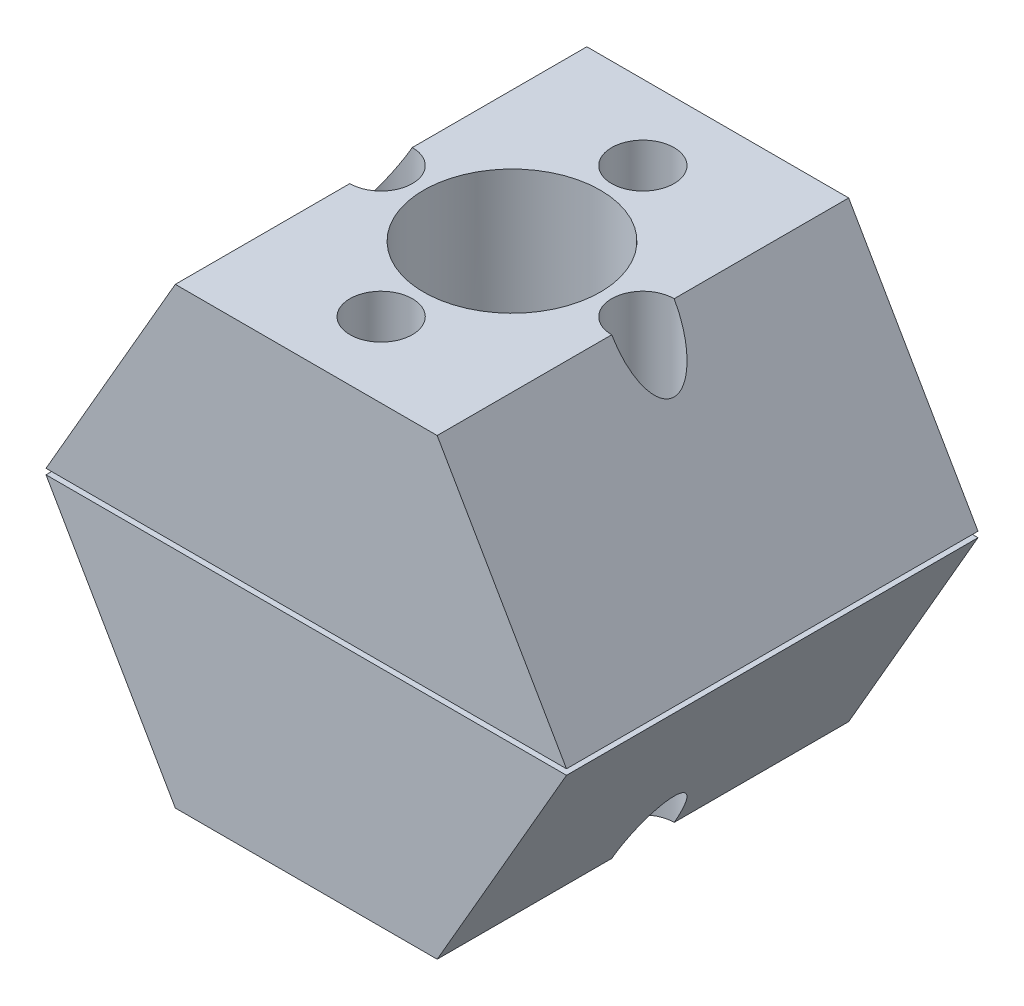
ISO-10303-21;
HEADER;
FILE_DESCRIPTION(('STEP AP214'),'2;1');
FILE_NAME('part.step','',(''),(''),'','','');
FILE_SCHEMA(('AUTOMOTIVE_DESIGN { 1 0 10303 214 1 1 1 1 }'));
ENDSEC;
DATA;
#1=APPLICATION_CONTEXT('core data for automotive mechanical design processes');
#2=APPLICATION_PROTOCOL_DEFINITION('international standard','automotive_design',2000,#1);
#3=PRODUCT_CONTEXT('',#1,'mechanical');
#4=PRODUCT('Part','Part','',(#3));
#5=PRODUCT_RELATED_PRODUCT_CATEGORY('part','',(#4));
#6=PRODUCT_DEFINITION_FORMATION('','',#4);
#7=PRODUCT_DEFINITION_CONTEXT('part definition',#1,'design');
#8=PRODUCT_DEFINITION('design','',#6,#7);
#9=PRODUCT_DEFINITION_SHAPE('','',#8);
#10=(LENGTH_UNIT() NAMED_UNIT(*) SI_UNIT(.MILLI.,.METRE.));
#11=(NAMED_UNIT(*) PLANE_ANGLE_UNIT() SI_UNIT($,.RADIAN.));
#12=(NAMED_UNIT(*) SI_UNIT($,.STERADIAN.) SOLID_ANGLE_UNIT());
#13=UNCERTAINTY_MEASURE_WITH_UNIT(LENGTH_MEASURE(1.E-05),#10,'distance_accuracy_value','');
#14=(GEOMETRIC_REPRESENTATION_CONTEXT(3) GLOBAL_UNCERTAINTY_ASSIGNED_CONTEXT((#13)) GLOBAL_UNIT_ASSIGNED_CONTEXT((#10,
#11,#12)) REPRESENTATION_CONTEXT('',''));
#15=CARTESIAN_POINT('',(0.,0.,0.));
#16=DIRECTION('',(0.,0.,1.));
#17=DIRECTION('',(1.,0.,0.));
#18=AXIS2_PLACEMENT_3D('',#15,#16,#17);
#19=CARTESIAN_POINT('',(8.885,18.7479316792872,0.));
#20=DIRECTION('',(0.,-1.,0.));
#21=DIRECTION('',(0.,0.,-1.));
#22=AXIS2_PLACEMENT_3D('',#19,#20,#21);
#23=CYLINDRICAL_SURFACE('',#22,0.849999999999996);
#24=CARTESIAN_POINT('',(8.885,5.58099999999986,0.));
#25=DIRECTION('',(0.,1.,0.));
#26=DIRECTION('',(-1.,0.,0.));
#27=AXIS2_PLACEMENT_3D('',#24,#25,#26);
#28=CIRCLE('',#27,0.849999999999996);
#29=CARTESIAN_POINT('',(8.035,5.58099999999986,0.));
#30=VERTEX_POINT('',#29);
#31=EDGE_CURVE('E186',#30,#30,#28,.T.);
#32=ORIENTED_EDGE('',*,*,#31,.F.);
#33=EDGE_LOOP('',(#32));
#34=FACE_BOUND('',#33,.T.);
#35=CARTESIAN_POINT('',(8.885,9.22293167928716,0.));
#36=DIRECTION('',(0.,1.,0.));
#37=DIRECTION('',(-1.,0.,0.));
#38=AXIS2_PLACEMENT_3D('',#35,#36,#37);
#39=CIRCLE('',#38,0.849999999999996);
#40=CARTESIAN_POINT('',(8.035,9.22293167928716,0.));
#41=VERTEX_POINT('',#40);
#42=EDGE_CURVE('E183',#41,#41,#39,.F.);
#43=ORIENTED_EDGE('',*,*,#42,.F.);
#44=EDGE_LOOP('',(#43));
#45=FACE_BOUND('',#44,.T.);
#46=ADVANCED_FACE('F52',(#34,#45),#23,.F.);
#47=CARTESIAN_POINT('',(-8.885,18.7479316792872,0.));
#48=DIRECTION('',(0.,-1.,0.));
#49=DIRECTION('',(0.,0.,-1.));
#50=AXIS2_PLACEMENT_3D('',#47,#48,#49);
#51=CYLINDRICAL_SURFACE('',#50,0.849999999999996);
#52=CARTESIAN_POINT('',(-8.885,5.58099999999986,0.));
#53=DIRECTION('',(0.,1.,0.));
#54=DIRECTION('',(-1.,0.,0.));
#55=AXIS2_PLACEMENT_3D('',#52,#53,#54);
#56=CIRCLE('',#55,0.849999999999996);
#57=CARTESIAN_POINT('',(-9.73499999999999,5.58099999999986,0.));
#58=VERTEX_POINT('',#57);
#59=EDGE_CURVE('E519',#58,#58,#56,.T.);
#60=ORIENTED_EDGE('',*,*,#59,.F.);
#61=EDGE_LOOP('',(#60));
#62=FACE_BOUND('',#61,.T.);
#63=CARTESIAN_POINT('',(-8.885,9.22293167928716,0.));
#64=DIRECTION('',(0.,1.,0.));
#65=DIRECTION('',(-1.,0.,0.));
#66=AXIS2_PLACEMENT_3D('',#63,#64,#65);
#67=CIRCLE('',#66,0.849999999999996);
#68=CARTESIAN_POINT('',(-9.73499999999999,9.22293167928716,0.));
#69=VERTEX_POINT('',#68);
#70=EDGE_CURVE('E179',#69,#69,#67,.F.);
#71=ORIENTED_EDGE('',*,*,#70,.F.);
#72=EDGE_LOOP('',(#71));
#73=FACE_BOUND('',#72,.T.);
#74=ADVANCED_FACE('F244',(#62,#73),#51,.F.);
#75=CARTESIAN_POINT('',(0.,18.7479316792872,-8.885));
#76=DIRECTION('',(0.,-1.,0.));
#77=DIRECTION('',(0.,0.,-1.));
#78=AXIS2_PLACEMENT_3D('',#75,#76,#77);
#79=CYLINDRICAL_SURFACE('',#78,0.849999999999997);
#80=CARTESIAN_POINT('',(0.,5.58099999999986,-8.885));
#81=DIRECTION('',(0.,1.,0.));
#82=DIRECTION('',(-1.,0.,0.));
#83=AXIS2_PLACEMENT_3D('',#80,#81,#82);
#84=CIRCLE('',#83,0.849999999999997);
#85=CARTESIAN_POINT('',(-0.85000000000009,5.58099999999986,-8.885));
#86=VERTEX_POINT('',#85);
#87=EDGE_CURVE('E513',#86,#86,#84,.T.);
#88=ORIENTED_EDGE('',*,*,#87,.F.);
#89=EDGE_LOOP('',(#88));
#90=FACE_BOUND('',#89,.T.);
#91=CARTESIAN_POINT('',(0.,9.22293167928716,-8.885));
#92=DIRECTION('',(0.,1.,0.));
#93=DIRECTION('',(-1.,0.,0.));
#94=AXIS2_PLACEMENT_3D('',#91,#92,#93);
#95=CIRCLE('',#94,0.849999999999997);
#96=CARTESIAN_POINT('',(-0.85000000000009,9.22293167928716,-8.885));
#97=VERTEX_POINT('',#96);
#98=EDGE_CURVE('E174',#97,#97,#95,.F.);
#99=ORIENTED_EDGE('',*,*,#98,.F.);
#100=EDGE_LOOP('',(#99));
#101=FACE_BOUND('',#100,.T.);
#102=ADVANCED_FACE('F239',(#90,#101),#79,.F.);
#103=CARTESIAN_POINT('',(0.,18.7479316792872,8.885));
#104=DIRECTION('',(0.,-1.,0.));
#105=DIRECTION('',(0.,0.,-1.));
#106=AXIS2_PLACEMENT_3D('',#103,#104,#105);
#107=CYLINDRICAL_SURFACE('',#106,0.849999999999997);
#108=CARTESIAN_POINT('',(0.,5.58099999999986,8.885));
#109=DIRECTION('',(0.,1.,0.));
#110=DIRECTION('',(-1.,0.,0.));
#111=AXIS2_PLACEMENT_3D('',#108,#109,#110);
#112=CIRCLE('',#111,0.849999999999997);
#113=CARTESIAN_POINT('',(-0.849999999999966,5.58099999999986,8.885));
#114=VERTEX_POINT('',#113);
#115=EDGE_CURVE('E518',#114,#114,#112,.T.);
#116=ORIENTED_EDGE('',*,*,#115,.F.);
#117=EDGE_LOOP('',(#116));
#118=FACE_BOUND('',#117,.T.);
#119=CARTESIAN_POINT('',(0.,9.22293167928716,8.885));
#120=DIRECTION('',(0.,1.,0.));
#121=DIRECTION('',(-1.,0.,0.));
#122=AXIS2_PLACEMENT_3D('',#119,#120,#121);
#123=CIRCLE('',#122,0.849999999999997);
#124=CARTESIAN_POINT('',(-0.849999999999966,9.22293167928716,8.885));
#125=VERTEX_POINT('',#124);
#126=EDGE_CURVE('E170',#125,#125,#123,.F.);
#127=ORIENTED_EDGE('',*,*,#126,.F.);
#128=EDGE_LOOP('',(#127));
#129=FACE_BOUND('',#128,.T.);
#130=ADVANCED_FACE('F233',(#118,#129),#107,.F.);
#131=CARTESIAN_POINT('',(0.,0.,13.97));
#132=DIRECTION('',(0.,0.,1.));
#133=DIRECTION('',(1.,0.,0.));
#134=AXIS2_PLACEMENT_3D('',#131,#132,#133);
#135=PLANE('',#134);
#136=DIRECTION('',(-1.,0.,0.));
#137=VECTOR('',#136,1.);
#138=CARTESIAN_POINT('',(0.,18.7479316792872,13.97));
#139=LINE('',#138,#137);
#140=CARTESIAN_POINT('',(8.89,18.7479316792872,13.97));
#141=VERTEX_POINT('',#140);
#142=CARTESIAN_POINT('',(-8.89,18.7479316792872,13.97));
#143=VERTEX_POINT('',#142);
#144=EDGE_CURVE('E215',#141,#143,#139,.T.);
#145=ORIENTED_EDGE('',*,*,#144,.T.);
#146=DIRECTION('',(-0.5,-0.866025403784439,0.));
#147=VECTOR('',#146,1.);
#148=CARTESIAN_POINT('',(-14.7855925513389,8.53646583964361,13.97));
#149=LINE('',#148,#147);
#150=CARTESIAN_POINT('',(-17.6700147737194,3.54049999999984,13.97));
#151=VERTEX_POINT('',#150);
#152=EDGE_CURVE('E133',#143,#151,#149,.T.);
#153=ORIENTED_EDGE('',*,*,#152,.T.);
#154=DIRECTION('',(1.,0.,0.));
#155=VECTOR('',#154,1.);
#156=CARTESIAN_POINT('',(0.,3.54049999999984,13.97));
#157=LINE('',#156,#155);
#158=CARTESIAN_POINT('',(17.6700147737194,3.54049999999984,13.97));
#159=VERTEX_POINT('',#158);
#160=EDGE_CURVE('E156',#151,#159,#157,.T.);
#161=ORIENTED_EDGE('',*,*,#160,.T.);
#162=DIRECTION('',(-0.5,0.866025403784439,0.));
#163=VECTOR('',#162,1.);
#164=CARTESIAN_POINT('',(14.7855925513389,8.53646583964363,13.97));
#165=LINE('',#164,#163);
#166=EDGE_CURVE('E224',#159,#141,#165,.T.);
#167=ORIENTED_EDGE('',*,*,#166,.T.);
#168=EDGE_LOOP('',(#145,#153,#161,#167));
#169=FACE_BOUND('',#168,.T.);
#170=ADVANCED_FACE('F231',(#169),#135,.T.);
#171=CARTESIAN_POINT('',(0.,0.,-13.97));
#172=DIRECTION('',(0.,0.,1.));
#173=DIRECTION('',(1.,0.,0.));
#174=AXIS2_PLACEMENT_3D('',#171,#172,#173);
#175=PLANE('',#174);
#176=DIRECTION('',(-0.5,-0.866025403784439,0.));
#177=VECTOR('',#176,1.);
#178=CARTESIAN_POINT('',(-14.7855925513389,8.53646583964361,-13.97));
#179=LINE('',#178,#177);
#180=CARTESIAN_POINT('',(-8.89,18.7479316792872,-13.97));
#181=VERTEX_POINT('',#180);
#182=CARTESIAN_POINT('',(-17.6700147737194,3.54049999999984,-13.97));
#183=VERTEX_POINT('',#182);
#184=EDGE_CURVE('E167',#181,#183,#179,.T.);
#185=ORIENTED_EDGE('',*,*,#184,.F.);
#186=DIRECTION('',(-1.,0.,0.));
#187=VECTOR('',#186,1.);
#188=CARTESIAN_POINT('',(0.,18.7479316792872,-13.97));
#189=LINE('',#188,#187);
#190=CARTESIAN_POINT('',(8.89,18.7479316792872,-13.97));
#191=VERTEX_POINT('',#190);
#192=EDGE_CURVE('E164',#191,#181,#189,.T.);
#193=ORIENTED_EDGE('',*,*,#192,.F.);
#194=DIRECTION('',(-0.5,0.866025403784439,0.));
#195=VECTOR('',#194,1.);
#196=CARTESIAN_POINT('',(14.7855925513389,8.53646583964363,-13.97));
#197=LINE('',#196,#195);
#198=CARTESIAN_POINT('',(17.6700147737194,3.54049999999984,-13.97));
#199=VERTEX_POINT('',#198);
#200=EDGE_CURVE('E159',#199,#191,#197,.T.);
#201=ORIENTED_EDGE('',*,*,#200,.F.);
#202=DIRECTION('',(1.,0.,0.));
#203=VECTOR('',#202,1.);
#204=CARTESIAN_POINT('',(0.,3.54049999999984,-13.97));
#205=LINE('',#204,#203);
#206=EDGE_CURVE('E155',#183,#199,#205,.T.);
#207=ORIENTED_EDGE('',*,*,#206,.F.);
#208=EDGE_LOOP('',(#185,#193,#201,#207));
#209=FACE_BOUND('',#208,.T.);
#210=ADVANCED_FACE('F206',(#209),#175,.F.);
#211=CARTESIAN_POINT('',(0.,3.54049999999984,13.97));
#212=DIRECTION('',(0.,1.,0.));
#213=DIRECTION('',(-1.,0.,0.));
#214=AXIS2_PLACEMENT_3D('',#211,#212,#213);
#215=PLANE('',#214);
#216=CARTESIAN_POINT('',(0.,3.54049999999984,0.));
#217=DIRECTION('',(0.,1.,0.));
#218=DIRECTION('',(-1.,0.,0.));
#219=AXIS2_PLACEMENT_3D('',#216,#217,#218);
#220=CIRCLE('',#219,11.381);
#221=CARTESIAN_POINT('',(-11.381,3.54049999999984,0.));
#222=VERTEX_POINT('',#221);
#223=EDGE_CURVE('E151',#222,#222,#220,.T.);
#224=ORIENTED_EDGE('',*,*,#223,.T.);
#225=EDGE_LOOP('',(#224));
#226=FACE_BOUND('',#225,.T.);
#227=ORIENTED_EDGE('',*,*,#206,.T.);
#228=DIRECTION('',(0.,0.,1.));
#229=VECTOR('',#228,1.);
#230=CARTESIAN_POINT('',(17.6700147737194,3.54049999999984,-42.8415180768081));
#231=LINE('',#230,#229);
#232=EDGE_CURVE('E202',#199,#159,#231,.T.);
#233=ORIENTED_EDGE('',*,*,#232,.T.);
#234=ORIENTED_EDGE('',*,*,#160,.F.);
#235=DIRECTION('',(0.,0.,1.));
#236=VECTOR('',#235,1.);
#237=CARTESIAN_POINT('',(-17.6700147737194,3.54049999999984,-42.8415180768081));
#238=LINE('',#237,#236);
#239=EDGE_CURVE('E208',#183,#151,#238,.T.);
#240=ORIENTED_EDGE('',*,*,#239,.F.);
#241=EDGE_LOOP('',(#227,#233,#234,#240));
#242=FACE_BOUND('',#241,.T.);
#243=ADVANCED_FACE('F54',(#226,#242),#215,.F.);
#244=CARTESIAN_POINT('',(0.,19.3099999999999,0.));
#245=DIRECTION('',(0.,1.,0.));
#246=DIRECTION('',(-1.,0.,0.));
#247=AXIS2_PLACEMENT_3D('',#244,#245,#246);
#248=CYLINDRICAL_SURFACE('',#247,11.381);
#249=CARTESIAN_POINT('',(0.,5.58099999999986,0.));
#250=DIRECTION('',(0.,1.,0.));
#251=DIRECTION('',(-1.,0.,0.));
#252=AXIS2_PLACEMENT_3D('',#249,#250,#251);
#253=CIRCLE('',#252,11.381);
#254=CARTESIAN_POINT('',(-11.381,5.58099999999986,0.));
#255=VERTEX_POINT('',#254);
#256=EDGE_CURVE('E140',#255,#255,#253,.T.);
#257=ORIENTED_EDGE('',*,*,#256,.T.);
#258=EDGE_LOOP('',(#257));
#259=FACE_BOUND('',#258,.T.);
#260=ORIENTED_EDGE('',*,*,#223,.F.);
#261=EDGE_LOOP('',(#260));
#262=FACE_BOUND('',#261,.T.);
#263=ADVANCED_FACE('F270',(#259,#262),#248,.F.);
#264=CARTESIAN_POINT('',(0.,5.58099999999986,0.));
#265=DIRECTION('',(0.,1.,0.));
#266=DIRECTION('',(-1.,0.,0.));
#267=AXIS2_PLACEMENT_3D('',#264,#265,#266);
#268=PLANE('',#267);
#269=ORIENTED_EDGE('',*,*,#115,.T.);
#270=EDGE_LOOP('',(#269));
#271=FACE_BOUND('',#270,.T.);
#272=ORIENTED_EDGE('',*,*,#87,.T.);
#273=EDGE_LOOP('',(#272));
#274=FACE_BOUND('',#273,.T.);
#275=ORIENTED_EDGE('',*,*,#31,.T.);
#276=EDGE_LOOP('',(#275));
#277=FACE_BOUND('',#276,.T.);
#278=ORIENTED_EDGE('',*,*,#59,.T.);
#279=EDGE_LOOP('',(#278));
#280=FACE_BOUND('',#279,.T.);
#281=CARTESIAN_POINT('',(0.,5.58099999999986,0.));
#282=DIRECTION('',(0.,1.,0.));
#283=DIRECTION('',(-1.,0.,0.));
#284=AXIS2_PLACEMENT_3D('',#281,#282,#283);
#285=CIRCLE('',#284,6.);
#286=CARTESIAN_POINT('',(-6.,5.58099999999986,0.));
#287=VERTEX_POINT('',#286);
#288=EDGE_CURVE('E212',#287,#287,#285,.F.);
#289=ORIENTED_EDGE('',*,*,#288,.F.);
#290=EDGE_LOOP('',(#289));
#291=FACE_BOUND('',#290,.T.);
#292=ORIENTED_EDGE('',*,*,#256,.F.);
#293=EDGE_LOOP('',(#292));
#294=FACE_BOUND('',#293,.T.);
#295=ADVANCED_FACE('F267',(#271,#274,#277,#280,#291,#294),#268,.F.);
#296=CARTESIAN_POINT('',(0.,18.7479316792872,-20.447));
#297=DIRECTION('',(0.,1.,0.));
#298=DIRECTION('',(-1.,0.,0.));
#299=AXIS2_PLACEMENT_3D('',#296,#297,#298);
#300=PLANE('',#299);
#301=CARTESIAN_POINT('',(0.,18.7479316792872,-8.885));
#302=DIRECTION('',(0.,1.,0.));
#303=DIRECTION('',(-1.,0.,0.));
#304=AXIS2_PLACEMENT_3D('',#301,#302,#303);
#305=CIRCLE('',#304,2.12);
#306=CARTESIAN_POINT('',(-2.12000000000008,18.7479316792872,-8.885));
#307=VERTEX_POINT('',#306);
#308=EDGE_CURVE('E537',#307,#307,#305,.T.);
#309=ORIENTED_EDGE('',*,*,#308,.F.);
#310=EDGE_LOOP('',(#309));
#311=FACE_BOUND('',#310,.T.);
#312=CARTESIAN_POINT('',(-8.88499999999999,18.7479316792872,0.));
#313=DIRECTION('',(0.,1.,0.));
#314=DIRECTION('',(-1.,0.,0.));
#315=AXIS2_PLACEMENT_3D('',#312,#313,#314);
#316=CIRCLE('',#315,2.12);
#317=CARTESIAN_POINT('',(-8.89,18.7479316792872,2.11999410376538));
#318=VERTEX_POINT('',#317);
#319=CARTESIAN_POINT('',(-8.89,18.7479316792872,-2.11999999999999));
#320=VERTEX_POINT('',#319);
#321=EDGE_CURVE('E69',#318,#320,#316,.T.);
#322=ORIENTED_EDGE('',*,*,#321,.F.);
#323=DIRECTION('',(0.,0.,1.));
#324=VECTOR('',#323,1.);
#325=CARTESIAN_POINT('',(-8.89,18.7479316792872,-20.447));
#326=LINE('',#325,#324);
#327=EDGE_CURVE('E124',#318,#143,#326,.T.);
#328=ORIENTED_EDGE('',*,*,#327,.T.);
#329=ORIENTED_EDGE('',*,*,#144,.F.);
#330=DIRECTION('',(0.,0.,1.));
#331=VECTOR('',#330,1.);
#332=CARTESIAN_POINT('',(8.89,18.7479316792872,-20.447));
#333=LINE('',#332,#331);
#334=CARTESIAN_POINT('',(8.89,18.7479316792872,2.11999999999993));
#335=VERTEX_POINT('',#334);
#336=EDGE_CURVE('E143',#335,#141,#333,.T.);
#337=ORIENTED_EDGE('',*,*,#336,.F.);
#338=CARTESIAN_POINT('',(8.885,18.7479316792872,0.));
#339=DIRECTION('',(0.,1.,0.));
#340=DIRECTION('',(-1.,0.,0.));
#341=AXIS2_PLACEMENT_3D('',#338,#339,#340);
#342=CIRCLE('',#341,2.12);
#343=CARTESIAN_POINT('',(8.89,18.7479316792872,-2.11999410376544));
#344=VERTEX_POINT('',#343);
#345=EDGE_CURVE('E79',#344,#335,#342,.T.);
#346=ORIENTED_EDGE('',*,*,#345,.F.);
#347=EDGE_CURVE('E136',#191,#344,#333,.T.);
#348=ORIENTED_EDGE('',*,*,#347,.F.);
#349=ORIENTED_EDGE('',*,*,#192,.T.);
#350=EDGE_CURVE('E126',#181,#320,#326,.T.);
#351=ORIENTED_EDGE('',*,*,#350,.T.);
#352=EDGE_LOOP('',(#322,#328,#329,#337,#346,#348,#349,#351));
#353=FACE_BOUND('',#352,.T.);
#354=CARTESIAN_POINT('',(0.,18.7479316792872,8.885));
#355=DIRECTION('',(0.,1.,0.));
#356=DIRECTION('',(-1.,0.,0.));
#357=AXIS2_PLACEMENT_3D('',#354,#355,#356);
#358=CIRCLE('',#357,2.12);
#359=CARTESIAN_POINT('',(-2.11999999999996,18.7479316792872,8.885));
#360=VERTEX_POINT('',#359);
#361=EDGE_CURVE('E550',#360,#360,#358,.T.);
#362=ORIENTED_EDGE('',*,*,#361,.F.);
#363=EDGE_LOOP('',(#362));
#364=FACE_BOUND('',#363,.T.);
#365=CARTESIAN_POINT('',(0.,18.7479316792872,0.));
#366=DIRECTION('',(0.,-1.,0.));
#367=DIRECTION('',(0.,0.,-1.));
#368=AXIS2_PLACEMENT_3D('',#365,#366,#367);
#369=CIRCLE('',#368,6.);
#370=CARTESIAN_POINT('',(0.,18.7479316792872,-6.));
#371=VERTEX_POINT('',#370);
#372=EDGE_CURVE('E219',#371,#371,#369,.F.);
#373=ORIENTED_EDGE('',*,*,#372,.F.);
#374=EDGE_LOOP('',(#373));
#375=FACE_BOUND('',#374,.T.);
#376=ADVANCED_FACE('F121',(#311,#353,#364,#375),#300,.T.);
#377=CARTESIAN_POINT('',(-14.7855925513389,8.53646583964361,-20.447));
#378=DIRECTION('',(-0.866025403784439,0.5,0.));
#379=DIRECTION('',(-0.5,-0.866025403784439,0.));
#380=AXIS2_PLACEMENT_3D('',#377,#378,#379);
#381=PLANE('',#380);
#382=CARTESIAN_POINT('',(-8.88499999999999,18.756591933325,0.));
#383=DIRECTION('',(-0.866025403784439,0.5,0.));
#384=DIRECTION('',(0.5,0.866025403784439,0.));
#385=AXIS2_PLACEMENT_3D('',#382,#383,#384);
#386=ELLIPSE('',#385,4.24,2.12);
#387=EDGE_CURVE('E12',#320,#318,#386,.T.);
#388=ORIENTED_EDGE('',*,*,#387,.F.);
#389=ORIENTED_EDGE('',*,*,#350,.F.);
#390=ORIENTED_EDGE('',*,*,#184,.T.);
#391=ORIENTED_EDGE('',*,*,#239,.T.);
#392=ORIENTED_EDGE('',*,*,#152,.F.);
#393=ORIENTED_EDGE('',*,*,#327,.F.);
#394=EDGE_LOOP('',(#388,#389,#390,#391,#392,#393));
#395=FACE_BOUND('',#394,.T.);
#396=ADVANCED_FACE('F131',(#395),#381,.T.);
#397=CARTESIAN_POINT('',(14.7855925513389,8.53646583964363,-20.447));
#398=DIRECTION('',(0.866025403784438,0.5,0.));
#399=DIRECTION('',(-0.5,0.866025403784439,0.));
#400=AXIS2_PLACEMENT_3D('',#397,#398,#399);
#401=PLANE('',#400);
#402=CARTESIAN_POINT('',(8.885,18.756591933325,0.));
#403=DIRECTION('',(0.866025403784438,0.5,0.));
#404=DIRECTION('',(-0.5,0.866025403784439,0.));
#405=AXIS2_PLACEMENT_3D('',#402,#403,#404);
#406=ELLIPSE('',#405,4.23999999999999,2.12);
#407=EDGE_CURVE('E61',#335,#344,#406,.T.);
#408=ORIENTED_EDGE('',*,*,#407,.F.);
#409=ORIENTED_EDGE('',*,*,#336,.T.);
#410=ORIENTED_EDGE('',*,*,#166,.F.);
#411=ORIENTED_EDGE('',*,*,#232,.F.);
#412=ORIENTED_EDGE('',*,*,#200,.T.);
#413=ORIENTED_EDGE('',*,*,#347,.T.);
#414=EDGE_LOOP('',(#408,#409,#410,#411,#412,#413));
#415=FACE_BOUND('',#414,.T.);
#416=ADVANCED_FACE('F198',(#415),#401,.T.);
#417=CARTESIAN_POINT('',(0.,18.7479316792872,0.));
#418=DIRECTION('',(0.,-1.,0.));
#419=DIRECTION('',(0.,0.,-1.));
#420=AXIS2_PLACEMENT_3D('',#417,#418,#419);
#421=CYLINDRICAL_SURFACE('',#420,6.);
#422=ORIENTED_EDGE('',*,*,#372,.T.);
#423=EDGE_LOOP('',(#422));
#424=FACE_BOUND('',#423,.T.);
#425=ORIENTED_EDGE('',*,*,#288,.T.);
#426=EDGE_LOOP('',(#425));
#427=FACE_BOUND('',#426,.T.);
#428=ADVANCED_FACE('F256',(#424,#427),#421,.F.);
#429=CARTESIAN_POINT('',(0.,9.22293167928716,8.885));
#430=DIRECTION('',(0.,1.,0.));
#431=DIRECTION('',(-1.,0.,0.));
#432=AXIS2_PLACEMENT_3D('',#429,#430,#431);
#433=PLANE('',#432);
#434=CARTESIAN_POINT('',(0.,9.22293167928716,8.885));
#435=DIRECTION('',(0.,1.,0.));
#436=DIRECTION('',(-1.,0.,0.));
#437=AXIS2_PLACEMENT_3D('',#434,#435,#436);
#438=CIRCLE('',#437,2.12);
#439=CARTESIAN_POINT('',(-2.11999999999996,9.22293167928716,8.885));
#440=VERTEX_POINT('',#439);
#441=EDGE_CURVE('E196',#440,#440,#438,.T.);
#442=ORIENTED_EDGE('',*,*,#441,.T.);
#443=EDGE_LOOP('',(#442));
#444=FACE_BOUND('',#443,.T.);
#445=ORIENTED_EDGE('',*,*,#126,.T.);
#446=EDGE_LOOP('',(#445));
#447=FACE_BOUND('',#446,.T.);
#448=ADVANCED_FACE('F259',(#444,#447),#433,.T.);
#449=CARTESIAN_POINT('',(0.,9.22293167928716,8.885));
#450=DIRECTION('',(0.,1.,0.));
#451=DIRECTION('',(-1.,0.,0.));
#452=AXIS2_PLACEMENT_3D('',#449,#450,#451);
#453=CYLINDRICAL_SURFACE('',#452,2.12);
#454=ORIENTED_EDGE('',*,*,#441,.F.);
#455=EDGE_LOOP('',(#454));
#456=FACE_BOUND('',#455,.T.);
#457=ORIENTED_EDGE('',*,*,#361,.T.);
#458=EDGE_LOOP('',(#457));
#459=FACE_BOUND('',#458,.T.);
#460=ADVANCED_FACE('F360',(#456,#459),#453,.F.);
#461=CARTESIAN_POINT('',(0.,9.22293167928716,-8.885));
#462=DIRECTION('',(0.,1.,0.));
#463=DIRECTION('',(-1.,0.,0.));
#464=AXIS2_PLACEMENT_3D('',#461,#462,#463);
#465=PLANE('',#464);
#466=CARTESIAN_POINT('',(0.,9.22293167928716,-8.885));
#467=DIRECTION('',(0.,1.,0.));
#468=DIRECTION('',(-1.,0.,0.));
#469=AXIS2_PLACEMENT_3D('',#466,#467,#468);
#470=CIRCLE('',#469,2.12);
#471=CARTESIAN_POINT('',(-2.12000000000009,9.22293167928716,-8.885));
#472=VERTEX_POINT('',#471);
#473=EDGE_CURVE('E175',#472,#472,#470,.T.);
#474=ORIENTED_EDGE('',*,*,#473,.T.);
#475=EDGE_LOOP('',(#474));
#476=FACE_BOUND('',#475,.T.);
#477=ORIENTED_EDGE('',*,*,#98,.T.);
#478=EDGE_LOOP('',(#477));
#479=FACE_BOUND('',#478,.T.);
#480=ADVANCED_FACE('F351',(#476,#479),#465,.T.);
#481=CARTESIAN_POINT('',(0.,9.22293167928716,-8.885));
#482=DIRECTION('',(0.,1.,0.));
#483=DIRECTION('',(-1.,0.,0.));
#484=AXIS2_PLACEMENT_3D('',#481,#482,#483);
#485=CYLINDRICAL_SURFACE('',#484,2.12);
#486=ORIENTED_EDGE('',*,*,#473,.F.);
#487=EDGE_LOOP('',(#486));
#488=FACE_BOUND('',#487,.T.);
#489=ORIENTED_EDGE('',*,*,#308,.T.);
#490=EDGE_LOOP('',(#489));
#491=FACE_BOUND('',#490,.T.);
#492=ADVANCED_FACE('F343',(#488,#491),#485,.F.);
#493=CARTESIAN_POINT('',(-8.88499999999999,9.22293167928716,0.));
#494=DIRECTION('',(0.,1.,0.));
#495=DIRECTION('',(-1.,0.,0.));
#496=AXIS2_PLACEMENT_3D('',#493,#494,#495);
#497=PLANE('',#496);
#498=CARTESIAN_POINT('',(-8.88499999999999,9.22293167928716,0.));
#499=DIRECTION('',(0.,1.,0.));
#500=DIRECTION('',(-1.,0.,0.));
#501=AXIS2_PLACEMENT_3D('',#498,#499,#500);
#502=CIRCLE('',#501,2.12);
#503=CARTESIAN_POINT('',(-11.005,9.22293167928716,0.));
#504=VERTEX_POINT('',#503);
#505=EDGE_CURVE('E128',#504,#504,#502,.T.);
#506=ORIENTED_EDGE('',*,*,#505,.T.);
#507=EDGE_LOOP('',(#506));
#508=FACE_BOUND('',#507,.T.);
#509=ORIENTED_EDGE('',*,*,#70,.T.);
#510=EDGE_LOOP('',(#509));
#511=FACE_BOUND('',#510,.T.);
#512=ADVANCED_FACE('F311',(#508,#511),#497,.T.);
#513=CARTESIAN_POINT('',(-8.88499999999999,9.22293167928716,0.));
#514=DIRECTION('',(0.,1.,0.));
#515=DIRECTION('',(-1.,0.,0.));
#516=AXIS2_PLACEMENT_3D('',#513,#514,#515);
#517=CYLINDRICAL_SURFACE('',#516,2.12);
#518=ORIENTED_EDGE('',*,*,#387,.T.);
#519=ORIENTED_EDGE('',*,*,#321,.T.);
#520=EDGE_LOOP('',(#518,#519));
#521=FACE_BOUND('',#520,.T.);
#522=ORIENTED_EDGE('',*,*,#505,.F.);
#523=EDGE_LOOP('',(#522));
#524=FACE_BOUND('',#523,.T.);
#525=ADVANCED_FACE('F114',(#521,#524),#517,.F.);
#526=CARTESIAN_POINT('',(8.885,9.22293167928716,0.));
#527=DIRECTION('',(0.,1.,0.));
#528=DIRECTION('',(-1.,0.,0.));
#529=AXIS2_PLACEMENT_3D('',#526,#527,#528);
#530=PLANE('',#529);
#531=CARTESIAN_POINT('',(8.885,9.22293167928716,0.));
#532=DIRECTION('',(0.,1.,0.));
#533=DIRECTION('',(-1.,0.,0.));
#534=AXIS2_PLACEMENT_3D('',#531,#532,#533);
#535=CIRCLE('',#534,2.12);
#536=CARTESIAN_POINT('',(6.765,9.22293167928716,0.));
#537=VERTEX_POINT('',#536);
#538=EDGE_CURVE('E129',#537,#537,#535,.T.);
#539=ORIENTED_EDGE('',*,*,#538,.T.);
#540=EDGE_LOOP('',(#539));
#541=FACE_BOUND('',#540,.T.);
#542=ORIENTED_EDGE('',*,*,#42,.T.);
#543=EDGE_LOOP('',(#542));
#544=FACE_BOUND('',#543,.T.);
#545=ADVANCED_FACE('F310',(#541,#544),#530,.T.);
#546=CARTESIAN_POINT('',(8.885,9.22293167928716,0.));
#547=DIRECTION('',(0.,1.,0.));
#548=DIRECTION('',(-1.,0.,0.));
#549=AXIS2_PLACEMENT_3D('',#546,#547,#548);
#550=CYLINDRICAL_SURFACE('',#549,2.12);
#551=ORIENTED_EDGE('',*,*,#407,.T.);
#552=ORIENTED_EDGE('',*,*,#345,.T.);
#553=EDGE_LOOP('',(#551,#552));
#554=FACE_BOUND('',#553,.T.);
#555=ORIENTED_EDGE('',*,*,#538,.F.);
#556=EDGE_LOOP('',(#555));
#557=FACE_BOUND('',#556,.T.);
#558=ADVANCED_FACE('F190',(#554,#557),#550,.F.);
#559=CLOSED_SHELL('',(#46,#74,#102,#130,#170,#210,#243,#263,#295,#376,#396,#416,#428,#448,#460,
#480,#492,#512,#525,#545,#558));
#560=MANIFOLD_SOLID_BREP('B2',#559);
#561=CARTESIAN_POINT('',(-8.885,18.7479316792872,0.));
#562=DIRECTION('',(0.,-1.,0.));
#563=DIRECTION('',(0.,0.,-1.));
#564=AXIS2_PLACEMENT_3D('',#561,#562,#563);
#565=CYLINDRICAL_SURFACE('',#564,0.849999999999996);
#566=CARTESIAN_POINT('',(-8.885,1.11899999999982,0.));
#567=DIRECTION('',(0.,-1.,0.));
#568=DIRECTION('',(0.,0.,-1.));
#569=AXIS2_PLACEMENT_3D('',#566,#567,#568);
#570=CIRCLE('',#569,0.849999999999996);
#571=CARTESIAN_POINT('',(-8.885,1.11899999999982,-0.849999999999996));
#572=VERTEX_POINT('',#571);
#573=EDGE_CURVE('E658',#572,#572,#570,.T.);
#574=ORIENTED_EDGE('',*,*,#573,.F.);
#575=EDGE_LOOP('',(#574));
#576=FACE_BOUND('',#575,.T.);
#577=CARTESIAN_POINT('',(-8.885,-2.52293167928749,0.));
#578=DIRECTION('',(0.,-1.,0.));
#579=DIRECTION('',(0.,0.,-1.));
#580=AXIS2_PLACEMENT_3D('',#577,#578,#579);
#581=CIRCLE('',#580,0.849999999999996);
#582=CARTESIAN_POINT('',(-8.885,-2.52293167928749,-0.849999999999996));
#583=VERTEX_POINT('',#582);
#584=EDGE_CURVE('E582',#583,#583,#581,.F.);
#585=ORIENTED_EDGE('',*,*,#584,.F.);
#586=EDGE_LOOP('',(#585));
#587=FACE_BOUND('',#586,.T.);
#588=ADVANCED_FACE('F578',(#576,#587),#565,.F.);
#589=CARTESIAN_POINT('',(8.885,18.7479316792872,0.));
#590=DIRECTION('',(0.,-1.,0.));
#591=DIRECTION('',(0.,0.,-1.));
#592=AXIS2_PLACEMENT_3D('',#589,#590,#591);
#593=CYLINDRICAL_SURFACE('',#592,0.849999999999996);
#594=CARTESIAN_POINT('',(8.885,1.11899999999982,0.));
#595=DIRECTION('',(0.,-1.,0.));
#596=DIRECTION('',(0.,0.,-1.));
#597=AXIS2_PLACEMENT_3D('',#594,#595,#596);
#598=CIRCLE('',#597,0.849999999999996);
#599=CARTESIAN_POINT('',(8.885,1.11899999999982,-0.850000000000058));
#600=VERTEX_POINT('',#599);
#601=EDGE_CURVE('E738',#600,#600,#598,.T.);
#602=ORIENTED_EDGE('',*,*,#601,.F.);
#603=EDGE_LOOP('',(#602));
#604=FACE_BOUND('',#603,.T.);
#605=CARTESIAN_POINT('',(8.885,-2.52293167928749,0.));
#606=DIRECTION('',(0.,-1.,0.));
#607=DIRECTION('',(0.,0.,-1.));
#608=AXIS2_PLACEMENT_3D('',#605,#606,#607);
#609=CIRCLE('',#608,0.849999999999996);
#610=CARTESIAN_POINT('',(8.885,-2.52293167928749,-0.850000000000058));
#611=VERTEX_POINT('',#610);
#612=EDGE_CURVE('E716',#611,#611,#609,.F.);
#613=ORIENTED_EDGE('',*,*,#612,.F.);
#614=EDGE_LOOP('',(#613));
#615=FACE_BOUND('',#614,.T.);
#616=ADVANCED_FACE('F813',(#604,#615),#593,.F.);
#617=CARTESIAN_POINT('',(0.,18.7479316792872,-8.885));
#618=DIRECTION('',(0.,-1.,0.));
#619=DIRECTION('',(0.,0.,-1.));
#620=AXIS2_PLACEMENT_3D('',#617,#618,#619);
#621=CYLINDRICAL_SURFACE('',#620,0.849999999999997);
#622=CARTESIAN_POINT('',(0.,1.11899999999982,-8.885));
#623=DIRECTION('',(0.,-1.,0.));
#624=DIRECTION('',(0.,0.,-1.));
#625=AXIS2_PLACEMENT_3D('',#622,#623,#624);
#626=CIRCLE('',#625,0.849999999999997);
#627=CARTESIAN_POINT('',(0.,1.11899999999982,-9.735));
#628=VERTEX_POINT('',#627);
#629=EDGE_CURVE('E741',#628,#628,#626,.T.);
#630=ORIENTED_EDGE('',*,*,#629,.F.);
#631=EDGE_LOOP('',(#630));
#632=FACE_BOUND('',#631,.T.);
#633=CARTESIAN_POINT('',(0.,-2.52293167928749,-8.885));
#634=DIRECTION('',(0.,-1.,0.));
#635=DIRECTION('',(0.,0.,-1.));
#636=AXIS2_PLACEMENT_3D('',#633,#634,#635);
#637=CIRCLE('',#636,0.849999999999997);
#638=CARTESIAN_POINT('',(0.,-2.52293167928749,-9.735));
#639=VERTEX_POINT('',#638);
#640=EDGE_CURVE('E713',#639,#639,#637,.F.);
#641=ORIENTED_EDGE('',*,*,#640,.F.);
#642=EDGE_LOOP('',(#641));
#643=FACE_BOUND('',#642,.T.);
#644=ADVANCED_FACE('F819',(#632,#643),#621,.F.);
#645=CARTESIAN_POINT('',(0.,18.7479316792872,8.885));
#646=DIRECTION('',(0.,-1.,0.));
#647=DIRECTION('',(0.,0.,-1.));
#648=AXIS2_PLACEMENT_3D('',#645,#646,#647);
#649=CYLINDRICAL_SURFACE('',#648,0.849999999999997);
#650=CARTESIAN_POINT('',(0.,1.11899999999982,8.885));
#651=DIRECTION('',(0.,-1.,0.));
#652=DIRECTION('',(0.,0.,-1.));
#653=AXIS2_PLACEMENT_3D('',#650,#651,#652);
#654=CIRCLE('',#653,0.849999999999997);
#655=CARTESIAN_POINT('',(0.,1.11899999999982,8.035));
#656=VERTEX_POINT('',#655);
#657=EDGE_CURVE('E745',#656,#656,#654,.T.);
#658=ORIENTED_EDGE('',*,*,#657,.F.);
#659=EDGE_LOOP('',(#658));
#660=FACE_BOUND('',#659,.T.);
#661=CARTESIAN_POINT('',(0.,-2.52293167928749,8.885));
#662=DIRECTION('',(0.,-1.,0.));
#663=DIRECTION('',(0.,0.,-1.));
#664=AXIS2_PLACEMENT_3D('',#661,#662,#663);
#665=CIRCLE('',#664,0.849999999999997);
#666=CARTESIAN_POINT('',(0.,-2.52293167928749,8.035));
#667=VERTEX_POINT('',#666);
#668=EDGE_CURVE('E709',#667,#667,#665,.F.);
#669=ORIENTED_EDGE('',*,*,#668,.F.);
#670=EDGE_LOOP('',(#669));
#671=FACE_BOUND('',#670,.T.);
#672=ADVANCED_FACE('F844',(#660,#671),#649,.F.);
#673=CARTESIAN_POINT('',(0.,0.,13.97));
#674=DIRECTION('',(0.,0.,1.));
#675=DIRECTION('',(1.,0.,0.));
#676=AXIS2_PLACEMENT_3D('',#673,#674,#675);
#677=PLANE('',#676);
#678=DIRECTION('',(0.5,-0.866025403784439,0.));
#679=VECTOR('',#678,1.);
#680=CARTESIAN_POINT('',(-11.8844074486611,-6.8614658396437,13.97));
#681=LINE('',#680,#679);
#682=CARTESIAN_POINT('',(-17.6700147737194,3.15949999999984,13.97));
#683=VERTEX_POINT('',#682);
#684=CARTESIAN_POINT('',(-8.88999999999999,-12.0479316792875,13.97));
#685=VERTEX_POINT('',#684);
#686=EDGE_CURVE('E695',#683,#685,#681,.T.);
#687=ORIENTED_EDGE('',*,*,#686,.T.);
#688=DIRECTION('',(1.,0.,0.));
#689=VECTOR('',#688,1.);
#690=CARTESIAN_POINT('',(0.,-12.0479316792875,13.97));
#691=LINE('',#690,#689);
#692=CARTESIAN_POINT('',(8.89000000000001,-12.0479316792875,13.97));
#693=VERTEX_POINT('',#692);
#694=EDGE_CURVE('E676',#685,#693,#691,.T.);
#695=ORIENTED_EDGE('',*,*,#694,.T.);
#696=DIRECTION('',(0.5,0.866025403784439,0.));
#697=VECTOR('',#696,1.);
#698=CARTESIAN_POINT('',(11.8844074486611,-6.8614658396437,13.97));
#699=LINE('',#698,#697);
#700=CARTESIAN_POINT('',(17.6700147737194,3.15949999999984,13.97));
#701=VERTEX_POINT('',#700);
#702=EDGE_CURVE('E692',#693,#701,#699,.T.);
#703=ORIENTED_EDGE('',*,*,#702,.T.);
#704=DIRECTION('',(-1.,0.,0.));
#705=VECTOR('',#704,1.);
#706=CARTESIAN_POINT('',(0.,3.15949999999984,13.97));
#707=LINE('',#706,#705);
#708=EDGE_CURVE('E700',#701,#683,#707,.T.);
#709=ORIENTED_EDGE('',*,*,#708,.T.);
#710=EDGE_LOOP('',(#687,#695,#703,#709));
#711=FACE_BOUND('',#710,.T.);
#712=ADVANCED_FACE('F771',(#711),#677,.T.);
#713=CARTESIAN_POINT('',(0.,0.,-13.97));
#714=DIRECTION('',(0.,0.,1.));
#715=DIRECTION('',(1.,0.,0.));
#716=AXIS2_PLACEMENT_3D('',#713,#714,#715);
#717=PLANE('',#716);
#718=DIRECTION('',(0.5,0.866025403784439,0.));
#719=VECTOR('',#718,1.);
#720=CARTESIAN_POINT('',(11.8844074486611,-6.8614658396437,-13.97));
#721=LINE('',#720,#719);
#722=CARTESIAN_POINT('',(8.89000000000001,-12.0479316792875,-13.97));
#723=VERTEX_POINT('',#722);
#724=CARTESIAN_POINT('',(17.6700147737194,3.15949999999984,-13.97));
#725=VERTEX_POINT('',#724);
#726=EDGE_CURVE('E50',#723,#725,#721,.T.);
#727=ORIENTED_EDGE('',*,*,#726,.F.);
#728=DIRECTION('',(-1.,0.,0.));
#729=VECTOR('',#728,1.);
#730=CARTESIAN_POINT('',(0.,-12.0479316792875,-13.97));
#731=LINE('',#730,#729);
#732=CARTESIAN_POINT('',(-8.88999999999999,-12.0479316792875,-13.97));
#733=VERTEX_POINT('',#732);
#734=EDGE_CURVE('E665',#723,#733,#731,.T.);
#735=ORIENTED_EDGE('',*,*,#734,.T.);
#736=DIRECTION('',(0.5,-0.866025403784439,0.));
#737=VECTOR('',#736,1.);
#738=CARTESIAN_POINT('',(-11.8844074486611,-6.8614658396437,-13.97));
#739=LINE('',#738,#737);
#740=CARTESIAN_POINT('',(-17.6700147737194,3.15949999999984,-13.97));
#741=VERTEX_POINT('',#740);
#742=EDGE_CURVE('E588',#741,#733,#739,.T.);
#743=ORIENTED_EDGE('',*,*,#742,.F.);
#744=DIRECTION('',(-1.,0.,0.));
#745=VECTOR('',#744,1.);
#746=CARTESIAN_POINT('',(0.,3.15949999999984,-13.97));
#747=LINE('',#746,#745);
#748=EDGE_CURVE('E699',#725,#741,#747,.T.);
#749=ORIENTED_EDGE('',*,*,#748,.F.);
#750=EDGE_LOOP('',(#727,#735,#743,#749));
#751=FACE_BOUND('',#750,.T.);
#752=ADVANCED_FACE('F775',(#751),#717,.F.);
#753=CARTESIAN_POINT('',(0.,3.15949999999984,13.97));
#754=DIRECTION('',(0.,-1.,0.));
#755=DIRECTION('',(0.,0.,-1.));
#756=AXIS2_PLACEMENT_3D('',#753,#754,#755);
#757=PLANE('',#756);
#758=CARTESIAN_POINT('',(0.,3.15949999999984,0.));
#759=DIRECTION('',(0.,1.,0.));
#760=DIRECTION('',(0.,0.,1.));
#761=AXIS2_PLACEMENT_3D('',#758,#759,#760);
#762=CIRCLE('',#761,11.381);
#763=CARTESIAN_POINT('',(0.,3.15949999999984,11.381));
#764=VERTEX_POINT('',#763);
#765=EDGE_CURVE('E684',#764,#764,#762,.T.);
#766=ORIENTED_EDGE('',*,*,#765,.F.);
#767=EDGE_LOOP('',(#766));
#768=FACE_BOUND('',#767,.T.);
#769=ORIENTED_EDGE('',*,*,#748,.T.);
#770=DIRECTION('',(0.,0.,1.));
#771=VECTOR('',#770,1.);
#772=CARTESIAN_POINT('',(-17.6700147737194,3.15949999999984,-42.8415180768081));
#773=LINE('',#772,#771);
#774=EDGE_CURVE('E757',#741,#683,#773,.T.);
#775=ORIENTED_EDGE('',*,*,#774,.T.);
#776=ORIENTED_EDGE('',*,*,#708,.F.);
#777=DIRECTION('',(0.,0.,1.));
#778=VECTOR('',#777,1.);
#779=CARTESIAN_POINT('',(17.6700147737194,3.15949999999984,-42.8415180768081));
#780=LINE('',#779,#778);
#781=EDGE_CURVE('E670',#725,#701,#780,.T.);
#782=ORIENTED_EDGE('',*,*,#781,.F.);
#783=EDGE_LOOP('',(#769,#775,#776,#782));
#784=FACE_BOUND('',#783,.T.);
#785=ADVANCED_FACE('F580',(#768,#784),#757,.F.);
#786=CARTESIAN_POINT('',(-11.8844074486611,-6.8614658396437,-20.447));
#787=DIRECTION('',(-0.866025403784439,-0.5,0.));
#788=DIRECTION('',(0.5,-0.866025403784439,0.));
#789=AXIS2_PLACEMENT_3D('',#786,#787,#788);
#790=PLANE('',#789);
#791=CARTESIAN_POINT('',(-8.885,-12.0565919333253,0.));
#792=DIRECTION('',(-0.866025403784439,-0.5,0.));
#793=DIRECTION('',(0.5,-0.866025403784439,0.));
#794=AXIS2_PLACEMENT_3D('',#791,#792,#793);
#795=ELLIPSE('',#794,4.23999999999999,2.12);
#796=CARTESIAN_POINT('',(-8.88999999999999,-12.0479316792875,2.11999410376538));
#797=VERTEX_POINT('',#796);
#798=CARTESIAN_POINT('',(-8.88999999999999,-12.0479316792875,-2.11999410376538));
#799=VERTEX_POINT('',#798);
#800=EDGE_CURVE('E598',#797,#799,#795,.T.);
#801=ORIENTED_EDGE('',*,*,#800,.F.);
#802=DIRECTION('',(0.,0.,1.));
#803=VECTOR('',#802,1.);
#804=CARTESIAN_POINT('',(-8.88999999999999,-12.0479316792875,-42.8415180768081));
#805=LINE('',#804,#803);
#806=EDGE_CURVE('E680',#797,#685,#805,.T.);
#807=ORIENTED_EDGE('',*,*,#806,.T.);
#808=ORIENTED_EDGE('',*,*,#686,.F.);
#809=ORIENTED_EDGE('',*,*,#774,.F.);
#810=ORIENTED_EDGE('',*,*,#742,.T.);
#811=EDGE_CURVE('E673',#733,#799,#805,.T.);
#812=ORIENTED_EDGE('',*,*,#811,.T.);
#813=EDGE_LOOP('',(#801,#807,#808,#809,#810,#812));
#814=FACE_BOUND('',#813,.T.);
#815=ADVANCED_FACE('F770',(#814),#790,.T.);
#816=CARTESIAN_POINT('',(11.8844074486611,-6.8614658396437,-20.447));
#817=DIRECTION('',(0.866025403784439,-0.5,0.));
#818=DIRECTION('',(0.5,0.866025403784439,0.));
#819=AXIS2_PLACEMENT_3D('',#816,#817,#818);
#820=PLANE('',#819);
#821=CARTESIAN_POINT('',(8.885,-12.0565919333253,0.));
#822=DIRECTION('',(0.866025403784439,-0.5,0.));
#823=DIRECTION('',(-0.5,-0.866025403784439,0.));
#824=AXIS2_PLACEMENT_3D('',#821,#822,#823);
#825=ELLIPSE('',#824,4.24,2.12);
#826=CARTESIAN_POINT('',(8.89000000000001,-12.0479316792875,-2.11999410376544));
#827=VERTEX_POINT('',#826);
#828=CARTESIAN_POINT('',(8.89000000000001,-12.0479316792875,2.11999410376532));
#829=VERTEX_POINT('',#828);
#830=EDGE_CURVE('E606',#827,#829,#825,.T.);
#831=ORIENTED_EDGE('',*,*,#830,.F.);
#832=DIRECTION('',(0.,0.,1.));
#833=VECTOR('',#832,1.);
#834=CARTESIAN_POINT('',(8.89000000000001,-12.0479316792875,-42.8415180768081));
#835=LINE('',#834,#833);
#836=EDGE_CURVE('E654',#723,#827,#835,.T.);
#837=ORIENTED_EDGE('',*,*,#836,.F.);
#838=ORIENTED_EDGE('',*,*,#726,.T.);
#839=ORIENTED_EDGE('',*,*,#781,.T.);
#840=ORIENTED_EDGE('',*,*,#702,.F.);
#841=EDGE_CURVE('E656',#829,#693,#835,.T.);
#842=ORIENTED_EDGE('',*,*,#841,.F.);
#843=EDGE_LOOP('',(#831,#837,#838,#839,#840,#842));
#844=FACE_BOUND('',#843,.T.);
#845=ADVANCED_FACE('F653',(#844),#820,.T.);
#846=CARTESIAN_POINT('',(0.,1.11899999999982,0.));
#847=DIRECTION('',(0.,-1.,0.));
#848=DIRECTION('',(0.,0.,-1.));
#849=AXIS2_PLACEMENT_3D('',#846,#847,#848);
#850=PLANE('',#849);
#851=ORIENTED_EDGE('',*,*,#657,.T.);
#852=EDGE_LOOP('',(#851));
#853=FACE_BOUND('',#852,.T.);
#854=ORIENTED_EDGE('',*,*,#629,.T.);
#855=EDGE_LOOP('',(#854));
#856=FACE_BOUND('',#855,.T.);
#857=ORIENTED_EDGE('',*,*,#601,.T.);
#858=EDGE_LOOP('',(#857));
#859=FACE_BOUND('',#858,.T.);
#860=ORIENTED_EDGE('',*,*,#573,.T.);
#861=EDGE_LOOP('',(#860));
#862=FACE_BOUND('',#861,.T.);
#863=CARTESIAN_POINT('',(0.,1.11899999999982,0.));
#864=DIRECTION('',(0.,-1.,0.));
#865=DIRECTION('',(0.,0.,-1.));
#866=AXIS2_PLACEMENT_3D('',#863,#864,#865);
#867=CIRCLE('',#866,6.);
#868=CARTESIAN_POINT('',(0.,1.11899999999982,-6.));
#869=VERTEX_POINT('',#868);
#870=EDGE_CURVE('E753',#869,#869,#867,.F.);
#871=ORIENTED_EDGE('',*,*,#870,.F.);
#872=EDGE_LOOP('',(#871));
#873=FACE_BOUND('',#872,.T.);
#874=CARTESIAN_POINT('',(0.,1.11899999999982,0.));
#875=DIRECTION('',(0.,1.,0.));
#876=DIRECTION('',(0.,0.,1.));
#877=AXIS2_PLACEMENT_3D('',#874,#875,#876);
#878=CIRCLE('',#877,11.381);
#879=CARTESIAN_POINT('',(0.,1.11899999999982,11.381));
#880=VERTEX_POINT('',#879);
#881=EDGE_CURVE('E688',#880,#880,#878,.T.);
#882=ORIENTED_EDGE('',*,*,#881,.T.);
#883=EDGE_LOOP('',(#882));
#884=FACE_BOUND('',#883,.T.);
#885=ADVANCED_FACE('F834',(#853,#856,#859,#862,#873,#884),#850,.F.);
#886=CARTESIAN_POINT('',(0.,15.8809999999999,0.));
#887=DIRECTION('',(0.,1.,0.));
#888=DIRECTION('',(0.,0.,1.));
#889=AXIS2_PLACEMENT_3D('',#886,#887,#888);
#890=CYLINDRICAL_SURFACE('',#889,11.381);
#891=ORIENTED_EDGE('',*,*,#765,.T.);
#892=EDGE_LOOP('',(#891));
#893=FACE_BOUND('',#892,.T.);
#894=ORIENTED_EDGE('',*,*,#881,.F.);
#895=EDGE_LOOP('',(#894));
#896=FACE_BOUND('',#895,.T.);
#897=ADVANCED_FACE('F831',(#893,#896),#890,.F.);
#898=CARTESIAN_POINT('',(0.,-12.0479316792875,-42.8415180768081));
#899=DIRECTION('',(0.,-1.,0.));
#900=DIRECTION('',(0.,0.,-1.));
#901=AXIS2_PLACEMENT_3D('',#898,#899,#900);
#902=PLANE('',#901);
#903=CARTESIAN_POINT('',(8.885,-12.0479316792875,0.));
#904=DIRECTION('',(0.,-1.,0.));
#905=DIRECTION('',(0.,0.,-1.));
#906=AXIS2_PLACEMENT_3D('',#903,#904,#905);
#907=CIRCLE('',#906,2.12);
#908=EDGE_CURVE('E641',#829,#827,#907,.T.);
#909=ORIENTED_EDGE('',*,*,#908,.F.);
#910=ORIENTED_EDGE('',*,*,#841,.T.);
#911=ORIENTED_EDGE('',*,*,#694,.F.);
#912=ORIENTED_EDGE('',*,*,#806,.F.);
#913=CARTESIAN_POINT('',(-8.885,-12.0479316792875,0.));
#914=DIRECTION('',(0.,-1.,0.));
#915=DIRECTION('',(0.,0.,-1.));
#916=AXIS2_PLACEMENT_3D('',#913,#914,#915);
#917=CIRCLE('',#916,2.12);
#918=EDGE_CURVE('E776',#799,#797,#917,.T.);
#919=ORIENTED_EDGE('',*,*,#918,.F.);
#920=ORIENTED_EDGE('',*,*,#811,.F.);
#921=ORIENTED_EDGE('',*,*,#734,.F.);
#922=ORIENTED_EDGE('',*,*,#836,.T.);
#923=EDGE_LOOP('',(#909,#910,#911,#912,#919,#920,#921,#922));
#924=FACE_BOUND('',#923,.T.);
#925=CARTESIAN_POINT('',(0.,-12.0479316792875,-8.885));
#926=DIRECTION('',(0.,-1.,0.));
#927=DIRECTION('',(0.,0.,-1.));
#928=AXIS2_PLACEMENT_3D('',#925,#926,#927);
#929=CIRCLE('',#928,2.12);
#930=CARTESIAN_POINT('',(0.,-12.0479316792875,-11.005));
#931=VERTEX_POINT('',#930);
#932=EDGE_CURVE('E649',#931,#931,#929,.T.);
#933=ORIENTED_EDGE('',*,*,#932,.F.);
#934=EDGE_LOOP('',(#933));
#935=FACE_BOUND('',#934,.T.);
#936=CARTESIAN_POINT('',(0.,-12.0479316792875,8.885));
#937=DIRECTION('',(0.,-1.,0.));
#938=DIRECTION('',(0.,0.,-1.));
#939=AXIS2_PLACEMENT_3D('',#936,#937,#938);
#940=CIRCLE('',#939,2.12);
#941=CARTESIAN_POINT('',(0.,-12.0479316792875,6.765));
#942=VERTEX_POINT('',#941);
#943=EDGE_CURVE('E784',#942,#942,#940,.T.);
#944=ORIENTED_EDGE('',*,*,#943,.F.);
#945=EDGE_LOOP('',(#944));
#946=FACE_BOUND('',#945,.T.);
#947=CARTESIAN_POINT('',(0.,-12.0479316792875,0.));
#948=DIRECTION('',(0.,-1.,0.));
#949=DIRECTION('',(0.,0.,-1.));
#950=AXIS2_PLACEMENT_3D('',#947,#948,#949);
#951=CIRCLE('',#950,6.);
#952=CARTESIAN_POINT('',(0.,-12.0479316792875,-6.));
#953=VERTEX_POINT('',#952);
#954=EDGE_CURVE('E749',#953,#953,#951,.F.);
#955=ORIENTED_EDGE('',*,*,#954,.T.);
#956=EDGE_LOOP('',(#955));
#957=FACE_BOUND('',#956,.T.);
#958=ADVANCED_FACE('F661',(#924,#935,#946,#957),#902,.T.);
#959=CARTESIAN_POINT('',(0.,18.7479316792872,0.));
#960=DIRECTION('',(0.,-1.,0.));
#961=DIRECTION('',(0.,0.,-1.));
#962=AXIS2_PLACEMENT_3D('',#959,#960,#961);
#963=CYLINDRICAL_SURFACE('',#962,6.);
#964=ORIENTED_EDGE('',*,*,#954,.F.);
#965=EDGE_LOOP('',(#964));
#966=FACE_BOUND('',#965,.T.);
#967=ORIENTED_EDGE('',*,*,#870,.T.);
#968=EDGE_LOOP('',(#967));
#969=FACE_BOUND('',#968,.T.);
#970=ADVANCED_FACE('F809',(#966,#969),#963,.F.);
#971=CARTESIAN_POINT('',(0.,-2.52293167928748,8.885));
#972=DIRECTION('',(0.,-1.,0.));
#973=DIRECTION('',(0.,0.,-1.));
#974=AXIS2_PLACEMENT_3D('',#971,#972,#973);
#975=PLANE('',#974);
#976=CARTESIAN_POINT('',(0.,-2.52293167928748,8.885));
#977=DIRECTION('',(0.,-1.,0.));
#978=DIRECTION('',(0.,0.,-1.));
#979=AXIS2_PLACEMENT_3D('',#976,#977,#978);
#980=CIRCLE('',#979,2.12);
#981=CARTESIAN_POINT('',(0.,-2.52293167928748,6.765));
#982=VERTEX_POINT('',#981);
#983=EDGE_CURVE('E732',#982,#982,#980,.T.);
#984=ORIENTED_EDGE('',*,*,#983,.T.);
#985=EDGE_LOOP('',(#984));
#986=FACE_BOUND('',#985,.T.);
#987=ORIENTED_EDGE('',*,*,#668,.T.);
#988=EDGE_LOOP('',(#987));
#989=FACE_BOUND('',#988,.T.);
#990=ADVANCED_FACE('F795',(#986,#989),#975,.T.);
#991=CARTESIAN_POINT('',(0.,-2.52293167928748,8.885));
#992=DIRECTION('',(0.,-1.,0.));
#993=DIRECTION('',(0.,0.,-1.));
#994=AXIS2_PLACEMENT_3D('',#991,#992,#993);
#995=CYLINDRICAL_SURFACE('',#994,2.12);
#996=ORIENTED_EDGE('',*,*,#983,.F.);
#997=EDGE_LOOP('',(#996));
#998=FACE_BOUND('',#997,.T.);
#999=ORIENTED_EDGE('',*,*,#943,.T.);
#1000=EDGE_LOOP('',(#999));
#1001=FACE_BOUND('',#1000,.T.);
#1002=ADVANCED_FACE('F798',(#998,#1001),#995,.F.);
#1003=CARTESIAN_POINT('',(0.,-2.52293167928748,-8.885));
#1004=DIRECTION('',(0.,-1.,0.));
#1005=DIRECTION('',(0.,0.,-1.));
#1006=AXIS2_PLACEMENT_3D('',#1003,#1004,#1005);
#1007=PLANE('',#1006);
#1008=CARTESIAN_POINT('',(0.,-2.52293167928748,-8.885));
#1009=DIRECTION('',(0.,-1.,0.));
#1010=DIRECTION('',(0.,0.,-1.));
#1011=AXIS2_PLACEMENT_3D('',#1008,#1009,#1010);
#1012=CIRCLE('',#1011,2.12);
#1013=CARTESIAN_POINT('',(0.,-2.52293167928748,-11.005));
#1014=VERTEX_POINT('',#1013);
#1015=EDGE_CURVE('E777',#1014,#1014,#1012,.T.);
#1016=ORIENTED_EDGE('',*,*,#1015,.T.);
#1017=EDGE_LOOP('',(#1016));
#1018=FACE_BOUND('',#1017,.T.);
#1019=ORIENTED_EDGE('',*,*,#640,.T.);
#1020=EDGE_LOOP('',(#1019));
#1021=FACE_BOUND('',#1020,.T.);
#1022=ADVANCED_FACE('F800',(#1018,#1021),#1007,.T.);
#1023=CARTESIAN_POINT('',(0.,-2.52293167928748,-8.885));
#1024=DIRECTION('',(0.,-1.,0.));
#1025=DIRECTION('',(0.,0.,-1.));
#1026=AXIS2_PLACEMENT_3D('',#1023,#1024,#1025);
#1027=CYLINDRICAL_SURFACE('',#1026,2.12);
#1028=ORIENTED_EDGE('',*,*,#1015,.F.);
#1029=EDGE_LOOP('',(#1028));
#1030=FACE_BOUND('',#1029,.T.);
#1031=ORIENTED_EDGE('',*,*,#932,.T.);
#1032=EDGE_LOOP('',(#1031));
#1033=FACE_BOUND('',#1032,.T.);
#1034=ADVANCED_FACE('F806',(#1030,#1033),#1027,.F.);
#1035=CARTESIAN_POINT('',(8.885,-2.52293167928748,0.));
#1036=DIRECTION('',(0.,-1.,0.));
#1037=DIRECTION('',(0.,0.,-1.));
#1038=AXIS2_PLACEMENT_3D('',#1035,#1036,#1037);
#1039=PLANE('',#1038);
#1040=CARTESIAN_POINT('',(8.885,-2.52293167928748,0.));
#1041=DIRECTION('',(0.,-1.,0.));
#1042=DIRECTION('',(0.,0.,-1.));
#1043=AXIS2_PLACEMENT_3D('',#1040,#1041,#1042);
#1044=CIRCLE('',#1043,2.12);
#1045=CARTESIAN_POINT('',(8.885,-2.52293167928748,-2.12000000000006));
#1046=VERTEX_POINT('',#1045);
#1047=EDGE_CURVE('E648',#1046,#1046,#1044,.T.);
#1048=ORIENTED_EDGE('',*,*,#1047,.T.);
#1049=EDGE_LOOP('',(#1048));
#1050=FACE_BOUND('',#1049,.T.);
#1051=ORIENTED_EDGE('',*,*,#612,.T.);
#1052=EDGE_LOOP('',(#1051));
#1053=FACE_BOUND('',#1052,.T.);
#1054=ADVANCED_FACE('F902',(#1050,#1053),#1039,.T.);
#1055=CARTESIAN_POINT('',(8.885,-2.52293167928748,0.));
#1056=DIRECTION('',(0.,-1.,0.));
#1057=DIRECTION('',(0.,0.,-1.));
#1058=AXIS2_PLACEMENT_3D('',#1055,#1056,#1057);
#1059=CYLINDRICAL_SURFACE('',#1058,2.12);
#1060=ORIENTED_EDGE('',*,*,#830,.T.);
#1061=ORIENTED_EDGE('',*,*,#908,.T.);
#1062=EDGE_LOOP('',(#1060,#1061));
#1063=FACE_BOUND('',#1062,.T.);
#1064=ORIENTED_EDGE('',*,*,#1047,.F.);
#1065=EDGE_LOOP('',(#1064));
#1066=FACE_BOUND('',#1065,.T.);
#1067=ADVANCED_FACE('F642',(#1063,#1066),#1059,.F.);
#1068=CARTESIAN_POINT('',(-8.885,-2.52293167928748,0.));
#1069=DIRECTION('',(0.,-1.,0.));
#1070=DIRECTION('',(0.,0.,-1.));
#1071=AXIS2_PLACEMENT_3D('',#1068,#1069,#1070);
#1072=PLANE('',#1071);
#1073=CARTESIAN_POINT('',(-8.885,-2.52293167928748,0.));
#1074=DIRECTION('',(0.,-1.,0.));
#1075=DIRECTION('',(0.,0.,-1.));
#1076=AXIS2_PLACEMENT_3D('',#1073,#1074,#1075);
#1077=CIRCLE('',#1076,2.12);
#1078=CARTESIAN_POINT('',(-8.885,-2.52293167928748,-2.12));
#1079=VERTEX_POINT('',#1078);
#1080=EDGE_CURVE('E778',#1079,#1079,#1077,.T.);
#1081=ORIENTED_EDGE('',*,*,#1080,.T.);
#1082=EDGE_LOOP('',(#1081));
#1083=FACE_BOUND('',#1082,.T.);
#1084=ORIENTED_EDGE('',*,*,#584,.T.);
#1085=EDGE_LOOP('',(#1084));
#1086=FACE_BOUND('',#1085,.T.);
#1087=ADVANCED_FACE('F921',(#1083,#1086),#1072,.T.);
#1088=CARTESIAN_POINT('',(-8.885,-2.52293167928748,0.));
#1089=DIRECTION('',(0.,-1.,0.));
#1090=DIRECTION('',(0.,0.,-1.));
#1091=AXIS2_PLACEMENT_3D('',#1088,#1089,#1090);
#1092=CYLINDRICAL_SURFACE('',#1091,2.12);
#1093=ORIENTED_EDGE('',*,*,#800,.T.);
#1094=ORIENTED_EDGE('',*,*,#918,.T.);
#1095=EDGE_LOOP('',(#1093,#1094));
#1096=FACE_BOUND('',#1095,.T.);
#1097=ORIENTED_EDGE('',*,*,#1080,.F.);
#1098=EDGE_LOOP('',(#1097));
#1099=FACE_BOUND('',#1098,.T.);
#1100=ADVANCED_FACE('F930',(#1096,#1099),#1092,.F.);
#1101=CLOSED_SHELL('',(#588,#616,#644,#672,#712,#752,#785,#815,#845,#885,#897,#958,#970,#990,
#1002,#1022,#1034,#1054,#1067,#1087,#1100));
#1102=MANIFOLD_SOLID_BREP('B6',#1101);
#1103=ADVANCED_BREP_SHAPE_REPRESENTATION('',(#18,#560,#1102),#14);
#1104=SHAPE_DEFINITION_REPRESENTATION(#9,#1103);
ENDSEC;
END-ISO-10303-21;
